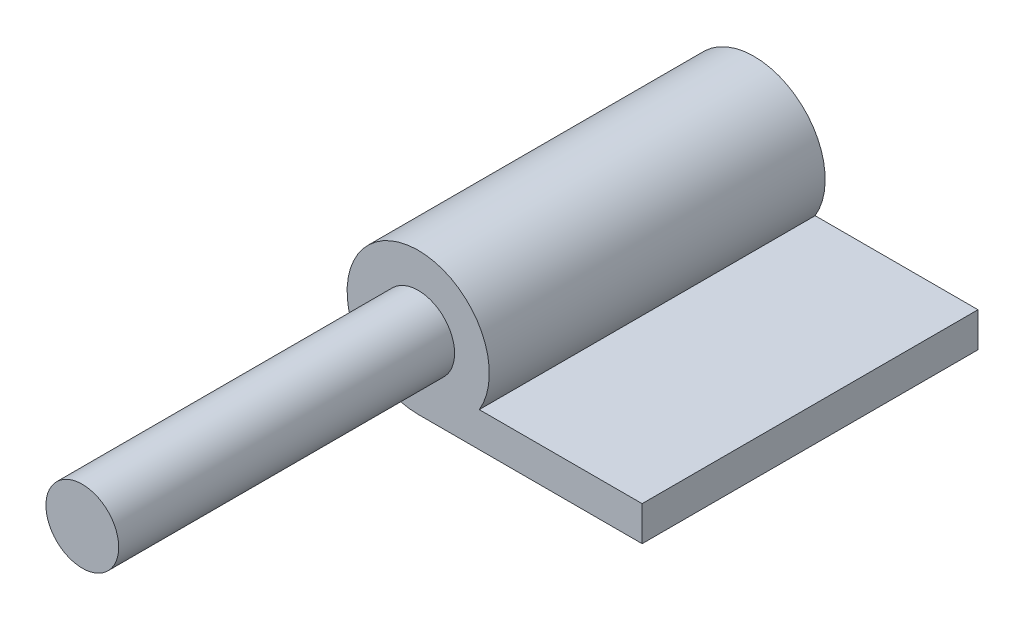
ISO-10303-21;
HEADER;
FILE_DESCRIPTION(('STEP AP214'),'2;1');
FILE_NAME('part.step','',(''),(''),'','','');
FILE_SCHEMA(('AUTOMOTIVE_DESIGN { 1 0 10303 214 1 1 1 1 }'));
ENDSEC;
DATA;
#1=APPLICATION_CONTEXT('core data for automotive mechanical design processes');
#2=APPLICATION_PROTOCOL_DEFINITION('international standard','automotive_design',2000,#1);
#3=PRODUCT_CONTEXT('',#1,'mechanical');
#4=PRODUCT('Part','Part','',(#3));
#5=PRODUCT_RELATED_PRODUCT_CATEGORY('part','',(#4));
#6=PRODUCT_DEFINITION_FORMATION('','',#4);
#7=PRODUCT_DEFINITION_CONTEXT('part definition',#1,'design');
#8=PRODUCT_DEFINITION('design','',#6,#7);
#9=PRODUCT_DEFINITION_SHAPE('','',#8);
#10=(LENGTH_UNIT() NAMED_UNIT(*) SI_UNIT(.MILLI.,.METRE.));
#11=(NAMED_UNIT(*) PLANE_ANGLE_UNIT() SI_UNIT($,.RADIAN.));
#12=(NAMED_UNIT(*) SI_UNIT($,.STERADIAN.) SOLID_ANGLE_UNIT());
#13=UNCERTAINTY_MEASURE_WITH_UNIT(LENGTH_MEASURE(1.E-05),#10,'distance_accuracy_value','');
#14=(GEOMETRIC_REPRESENTATION_CONTEXT(3) GLOBAL_UNCERTAINTY_ASSIGNED_CONTEXT((#13)) GLOBAL_UNIT_ASSIGNED_CONTEXT((#10,
#11,#12)) REPRESENTATION_CONTEXT('',''));
#15=CARTESIAN_POINT('',(0.,0.,0.));
#16=DIRECTION('',(0.,0.,1.));
#17=DIRECTION('',(1.,0.,0.));
#18=AXIS2_PLACEMENT_3D('',#15,#16,#17);
#19=CARTESIAN_POINT('',(0.,0.,15.));
#20=DIRECTION('',(0.,0.,-1.));
#21=DIRECTION('',(-1.,0.,0.));
#22=AXIS2_PLACEMENT_3D('',#19,#20,#21);
#23=CYLINDRICAL_SURFACE('',#22,6.35);
#24=DIRECTION('',(0.,0.,1.));
#25=VECTOR('',#24,1.);
#26=CARTESIAN_POINT('',(0.,-6.35,-15.));
#27=LINE('',#26,#25);
#28=CARTESIAN_POINT('',(0.,-6.35,-15.));
#29=VERTEX_POINT('',#28);
#30=CARTESIAN_POINT('',(0.,-6.35,15.));
#31=VERTEX_POINT('',#30);
#32=EDGE_CURVE('E95',#29,#31,#27,.T.);
#33=ORIENTED_EDGE('',*,*,#32,.T.);
#34=CARTESIAN_POINT('',(0.,0.,15.));
#35=DIRECTION('',(0.,0.,1.));
#36=DIRECTION('',(1.,0.,0.));
#37=AXIS2_PLACEMENT_3D('',#34,#35,#36);
#38=CIRCLE('',#37,6.35);
#39=CARTESIAN_POINT('',(5.45527267879434,-3.25,15.));
#40=VERTEX_POINT('',#39);
#41=EDGE_CURVE('E11',#40,#31,#38,.T.);
#42=ORIENTED_EDGE('',*,*,#41,.F.);
#43=DIRECTION('',(0.,0.,-1.));
#44=VECTOR('',#43,1.);
#45=CARTESIAN_POINT('',(5.45527267879434,-3.25,15.));
#46=LINE('',#45,#44);
#47=CARTESIAN_POINT('',(5.45527267879434,-3.25,-15.));
#48=VERTEX_POINT('',#47);
#49=EDGE_CURVE('E106',#48,#40,#46,.F.);
#50=ORIENTED_EDGE('',*,*,#49,.F.);
#51=CARTESIAN_POINT('',(0.,0.,-15.));
#52=DIRECTION('',(0.,0.,1.));
#53=DIRECTION('',(1.,0.,0.));
#54=AXIS2_PLACEMENT_3D('',#51,#52,#53);
#55=CIRCLE('',#54,6.35);
#56=EDGE_CURVE('E41',#48,#29,#55,.T.);
#57=ORIENTED_EDGE('',*,*,#56,.T.);
#58=EDGE_LOOP('',(#33,#42,#50,#57));
#59=FACE_BOUND('',#58,.T.);
#60=ADVANCED_FACE('F33',(#59),#23,.T.);
#61=CARTESIAN_POINT('',(0.,0.,15.));
#62=DIRECTION('',(0.,0.,1.));
#63=DIRECTION('',(1.,0.,0.));
#64=AXIS2_PLACEMENT_3D('',#61,#62,#63);
#65=PLANE('',#64);
#66=CARTESIAN_POINT('',(0.,0.,15.));
#67=DIRECTION('',(0.,0.,1.));
#68=DIRECTION('',(1.,0.,0.));
#69=AXIS2_PLACEMENT_3D('',#66,#67,#68);
#70=CIRCLE('',#69,3.25);
#71=CARTESIAN_POINT('',(3.25,0.,15.));
#72=VERTEX_POINT('',#71);
#73=EDGE_CURVE('E36',#72,#72,#70,.F.);
#74=ORIENTED_EDGE('',*,*,#73,.T.);
#75=EDGE_LOOP('',(#74));
#76=FACE_BOUND('',#75,.T.);
#77=ORIENTED_EDGE('',*,*,#41,.T.);
#78=DIRECTION('',(1.,0.,0.));
#79=VECTOR('',#78,1.);
#80=CARTESIAN_POINT('',(0.,-6.35,15.));
#81=LINE('',#80,#79);
#82=CARTESIAN_POINT('',(20.,-6.35,15.));
#83=VERTEX_POINT('',#82);
#84=EDGE_CURVE('E102',#31,#83,#81,.T.);
#85=ORIENTED_EDGE('',*,*,#84,.T.);
#86=DIRECTION('',(0.,1.,0.));
#87=VECTOR('',#86,1.);
#88=CARTESIAN_POINT('',(20.,0.,15.));
#89=LINE('',#88,#87);
#90=CARTESIAN_POINT('',(20.,-3.25,15.));
#91=VERTEX_POINT('',#90);
#92=EDGE_CURVE('E80',#83,#91,#89,.T.);
#93=ORIENTED_EDGE('',*,*,#92,.T.);
#94=DIRECTION('',(1.,0.,0.));
#95=VECTOR('',#94,1.);
#96=CARTESIAN_POINT('',(0.,-3.25,15.));
#97=LINE('',#96,#95);
#98=EDGE_CURVE('E48',#40,#91,#97,.T.);
#99=ORIENTED_EDGE('',*,*,#98,.F.);
#100=EDGE_LOOP('',(#77,#85,#93,#99));
#101=FACE_BOUND('',#100,.T.);
#102=ADVANCED_FACE('F111',(#76,#101),#65,.T.);
#103=CARTESIAN_POINT('',(0.,0.,-15.));
#104=DIRECTION('',(0.,0.,1.));
#105=DIRECTION('',(1.,0.,0.));
#106=AXIS2_PLACEMENT_3D('',#103,#104,#105);
#107=PLANE('',#106);
#108=ORIENTED_EDGE('',*,*,#56,.F.);
#109=DIRECTION('',(1.,0.,0.));
#110=VECTOR('',#109,1.);
#111=CARTESIAN_POINT('',(0.,-3.25,-15.));
#112=LINE('',#111,#110);
#113=CARTESIAN_POINT('',(20.,-3.25,-15.));
#114=VERTEX_POINT('',#113);
#115=EDGE_CURVE('E55',#48,#114,#112,.T.);
#116=ORIENTED_EDGE('',*,*,#115,.T.);
#117=DIRECTION('',(0.,1.,0.));
#118=VECTOR('',#117,1.);
#119=CARTESIAN_POINT('',(20.,0.,-15.));
#120=LINE('',#119,#118);
#121=CARTESIAN_POINT('',(20.,-6.35,-15.));
#122=VERTEX_POINT('',#121);
#123=EDGE_CURVE('E79',#122,#114,#120,.T.);
#124=ORIENTED_EDGE('',*,*,#123,.F.);
#125=DIRECTION('',(1.,0.,0.));
#126=VECTOR('',#125,1.);
#127=CARTESIAN_POINT('',(0.,-6.35,-15.));
#128=LINE('',#127,#126);
#129=EDGE_CURVE('E90',#29,#122,#128,.T.);
#130=ORIENTED_EDGE('',*,*,#129,.F.);
#131=EDGE_LOOP('',(#108,#116,#124,#130));
#132=FACE_BOUND('',#131,.T.);
#133=ADVANCED_FACE('F89',(#132),#107,.F.);
#134=CARTESIAN_POINT('',(0.,-3.25,-15.));
#135=DIRECTION('',(0.,-1.,0.));
#136=DIRECTION('',(0.,0.,-1.));
#137=AXIS2_PLACEMENT_3D('',#134,#135,#136);
#138=PLANE('',#137);
#139=ORIENTED_EDGE('',*,*,#115,.F.);
#140=ORIENTED_EDGE('',*,*,#49,.T.);
#141=ORIENTED_EDGE('',*,*,#98,.T.);
#142=DIRECTION('',(0.,0.,1.));
#143=VECTOR('',#142,1.);
#144=CARTESIAN_POINT('',(20.,-3.25,-15.));
#145=LINE('',#144,#143);
#146=EDGE_CURVE('E84',#114,#91,#145,.T.);
#147=ORIENTED_EDGE('',*,*,#146,.F.);
#148=EDGE_LOOP('',(#139,#140,#141,#147));
#149=FACE_BOUND('',#148,.T.);
#150=ADVANCED_FACE('F110',(#149),#138,.F.);
#151=CARTESIAN_POINT('',(0.,-6.35,-15.));
#152=DIRECTION('',(0.,-1.,0.));
#153=DIRECTION('',(0.,0.,-1.));
#154=AXIS2_PLACEMENT_3D('',#151,#152,#153);
#155=PLANE('',#154);
#156=ORIENTED_EDGE('',*,*,#84,.F.);
#157=ORIENTED_EDGE('',*,*,#32,.F.);
#158=ORIENTED_EDGE('',*,*,#129,.T.);
#159=DIRECTION('',(0.,0.,1.));
#160=VECTOR('',#159,1.);
#161=CARTESIAN_POINT('',(20.,-6.35,-15.));
#162=LINE('',#161,#160);
#163=EDGE_CURVE('E75',#122,#83,#162,.T.);
#164=ORIENTED_EDGE('',*,*,#163,.T.);
#165=EDGE_LOOP('',(#156,#157,#158,#164));
#166=FACE_BOUND('',#165,.T.);
#167=ADVANCED_FACE('F93',(#166),#155,.T.);
#168=CARTESIAN_POINT('',(20.,0.,-15.));
#169=DIRECTION('',(1.,0.,0.));
#170=DIRECTION('',(0.,0.,-1.));
#171=AXIS2_PLACEMENT_3D('',#168,#169,#170);
#172=PLANE('',#171);
#173=ORIENTED_EDGE('',*,*,#92,.F.);
#174=ORIENTED_EDGE('',*,*,#163,.F.);
#175=ORIENTED_EDGE('',*,*,#123,.T.);
#176=ORIENTED_EDGE('',*,*,#146,.T.);
#177=EDGE_LOOP('',(#173,#174,#175,#176));
#178=FACE_BOUND('',#177,.T.);
#179=ADVANCED_FACE('F77',(#178),#172,.T.);
#180=CARTESIAN_POINT('',(0.,0.,45.));
#181=DIRECTION('',(0.,0.,-1.));
#182=DIRECTION('',(-1.,0.,0.));
#183=AXIS2_PLACEMENT_3D('',#180,#181,#182);
#184=CYLINDRICAL_SURFACE('',#183,3.25);
#185=ORIENTED_EDGE('',*,*,#73,.F.);
#186=EDGE_LOOP('',(#185));
#187=FACE_BOUND('',#186,.T.);
#188=CARTESIAN_POINT('',(0.,0.,45.));
#189=DIRECTION('',(0.,0.,1.));
#190=DIRECTION('',(1.,0.,0.));
#191=AXIS2_PLACEMENT_3D('',#188,#189,#190);
#192=CIRCLE('',#191,3.25);
#193=CARTESIAN_POINT('',(3.25,0.,45.));
#194=VERTEX_POINT('',#193);
#195=EDGE_CURVE('E99',#194,#194,#192,.T.);
#196=ORIENTED_EDGE('',*,*,#195,.F.);
#197=EDGE_LOOP('',(#196));
#198=FACE_BOUND('',#197,.T.);
#199=ADVANCED_FACE('F125',(#187,#198),#184,.T.);
#200=CARTESIAN_POINT('',(0.,0.,45.));
#201=DIRECTION('',(0.,0.,1.));
#202=DIRECTION('',(1.,0.,0.));
#203=AXIS2_PLACEMENT_3D('',#200,#201,#202);
#204=PLANE('',#203);
#205=ORIENTED_EDGE('',*,*,#195,.T.);
#206=EDGE_LOOP('',(#205));
#207=FACE_BOUND('',#206,.T.);
#208=ADVANCED_FACE('F130',(#207),#204,.T.);
#209=CLOSED_SHELL('',(#60,#102,#133,#150,#167,#179,#199,#208));
#210=MANIFOLD_SOLID_BREP('B2',#209);
#211=ADVANCED_BREP_SHAPE_REPRESENTATION('',(#18,#210),#14);
#212=SHAPE_DEFINITION_REPRESENTATION(#9,#211);
ENDSEC;
END-ISO-10303-21;
